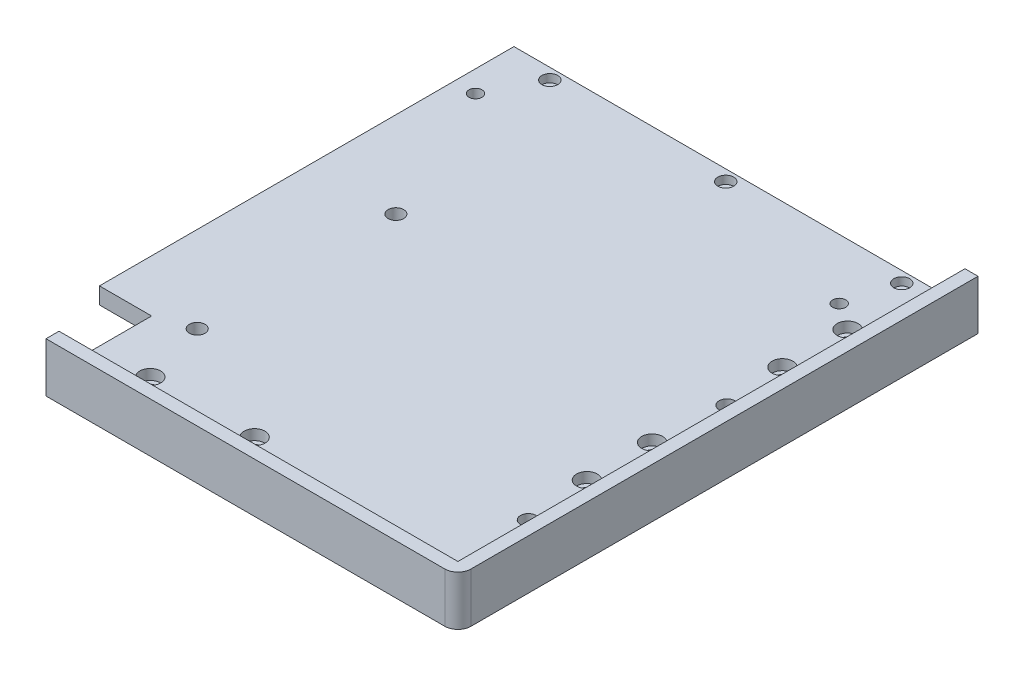
ISO-10303-21;
HEADER;
FILE_DESCRIPTION(('STEP AP214'),'2;1');
FILE_NAME('part.step','',(''),(''),'','','');
FILE_SCHEMA(('AUTOMOTIVE_DESIGN { 1 0 10303 214 1 1 1 1 }'));
ENDSEC;
DATA;
#1=APPLICATION_CONTEXT('core data for automotive mechanical design processes');
#2=APPLICATION_PROTOCOL_DEFINITION('international standard','automotive_design',2000,#1);
#3=PRODUCT_CONTEXT('',#1,'mechanical');
#4=PRODUCT('Part','Part','',(#3));
#5=PRODUCT_RELATED_PRODUCT_CATEGORY('part','',(#4));
#6=PRODUCT_DEFINITION_FORMATION('','',#4);
#7=PRODUCT_DEFINITION_CONTEXT('part definition',#1,'design');
#8=PRODUCT_DEFINITION('design','',#6,#7);
#9=PRODUCT_DEFINITION_SHAPE('','',#8);
#10=(LENGTH_UNIT() NAMED_UNIT(*) SI_UNIT(.MILLI.,.METRE.));
#11=(NAMED_UNIT(*) PLANE_ANGLE_UNIT() SI_UNIT($,.RADIAN.));
#12=(NAMED_UNIT(*) SI_UNIT($,.STERADIAN.) SOLID_ANGLE_UNIT());
#13=UNCERTAINTY_MEASURE_WITH_UNIT(LENGTH_MEASURE(1.E-05),#10,'distance_accuracy_value','');
#14=(GEOMETRIC_REPRESENTATION_CONTEXT(3) GLOBAL_UNCERTAINTY_ASSIGNED_CONTEXT((#13)) GLOBAL_UNIT_ASSIGNED_CONTEXT((#10,
#11,#12)) REPRESENTATION_CONTEXT('',''));
#15=CARTESIAN_POINT('',(0.,0.,0.));
#16=DIRECTION('',(0.,0.,1.));
#17=DIRECTION('',(1.,0.,0.));
#18=AXIS2_PLACEMENT_3D('',#15,#16,#17);
#19=CARTESIAN_POINT('',(0.,6.35,0.));
#20=DIRECTION('',(1.,0.,0.));
#21=DIRECTION('',(0.,0.,-1.));
#22=AXIS2_PLACEMENT_3D('',#19,#20,#21);
#23=PLANE('',#22);
#24=DIRECTION('',(0.,1.,0.));
#25=VECTOR('',#24,1.);
#26=CARTESIAN_POINT('',(0.,-160.252925090308,159.));
#27=LINE('',#26,#25);
#28=CARTESIAN_POINT('',(0.,0.,159.));
#29=VERTEX_POINT('',#28);
#30=CARTESIAN_POINT('',(0.,6.35,159.));
#31=VERTEX_POINT('',#30);
#32=EDGE_CURVE('E56',#29,#31,#27,.T.);
#33=ORIENTED_EDGE('',*,*,#32,.F.);
#34=DIRECTION('',(0.,0.,1.));
#35=VECTOR('',#34,1.);
#36=CARTESIAN_POINT('',(0.,0.,0.));
#37=LINE('',#36,#35);
#38=CARTESIAN_POINT('',(0.,0.,199.5));
#39=VERTEX_POINT('',#38);
#40=EDGE_CURVE('E257',#29,#39,#37,.T.);
#41=ORIENTED_EDGE('',*,*,#40,.T.);
#42=DIRECTION('',(0.,-1.,0.));
#43=VECTOR('',#42,1.);
#44=CARTESIAN_POINT('',(0.,6.35,199.5));
#45=LINE('',#44,#43);
#46=CARTESIAN_POINT('',(0.,19.05,199.5));
#47=VERTEX_POINT('',#46);
#48=EDGE_CURVE('E266',#47,#39,#45,.T.);
#49=ORIENTED_EDGE('',*,*,#48,.F.);
#50=DIRECTION('',(0.,0.,1.));
#51=VECTOR('',#50,1.);
#52=CARTESIAN_POINT('',(0.,19.05,199.5));
#53=LINE('',#52,#51);
#54=CARTESIAN_POINT('',(0.,19.05,194.5));
#55=VERTEX_POINT('',#54);
#56=EDGE_CURVE('E243',#55,#47,#53,.T.);
#57=ORIENTED_EDGE('',*,*,#56,.F.);
#58=DIRECTION('',(0.,-1.,0.));
#59=VECTOR('',#58,1.);
#60=CARTESIAN_POINT('',(0.,19.05,194.5));
#61=LINE('',#60,#59);
#62=CARTESIAN_POINT('',(0.,6.35,194.5));
#63=VERTEX_POINT('',#62);
#64=EDGE_CURVE('E246',#55,#63,#61,.T.);
#65=ORIENTED_EDGE('',*,*,#64,.T.);
#66=DIRECTION('',(0.,0.,1.));
#67=VECTOR('',#66,1.);
#68=CARTESIAN_POINT('',(0.,6.35,0.));
#69=LINE('',#68,#67);
#70=EDGE_CURVE('E131',#31,#63,#69,.T.);
#71=ORIENTED_EDGE('',*,*,#70,.F.);
#72=EDGE_LOOP('',(#33,#41,#49,#57,#65,#71));
#73=FACE_BOUND('',#72,.T.);
#74=ADVANCED_FACE('F41',(#73),#23,.F.);
#75=CARTESIAN_POINT('',(0.,6.35,199.5));
#76=DIRECTION('',(0.,0.,-1.));
#77=DIRECTION('',(-1.,0.,0.));
#78=AXIS2_PLACEMENT_3D('',#75,#76,#77);
#79=PLANE('',#78);
#80=DIRECTION('',(1.,0.,0.));
#81=VECTOR('',#80,1.);
#82=CARTESIAN_POINT('',(0.,0.,199.5));
#83=LINE('',#82,#81);
#84=CARTESIAN_POINT('',(153.,0.,199.5));
#85=VERTEX_POINT('',#84);
#86=EDGE_CURVE('E260',#39,#85,#83,.T.);
#87=ORIENTED_EDGE('',*,*,#86,.T.);
#88=DIRECTION('',(0.,-1.,0.));
#89=VECTOR('',#88,1.);
#90=CARTESIAN_POINT('',(153.,6.35,199.5));
#91=LINE('',#90,#89);
#92=CARTESIAN_POINT('',(153.,19.05,199.5));
#93=VERTEX_POINT('',#92);
#94=EDGE_CURVE('E49',#85,#93,#91,.F.);
#95=ORIENTED_EDGE('',*,*,#94,.T.);
#96=DIRECTION('',(1.,0.,0.));
#97=VECTOR('',#96,1.);
#98=CARTESIAN_POINT('',(0.,19.05,199.5));
#99=LINE('',#98,#97);
#100=EDGE_CURVE('E232',#47,#93,#99,.T.);
#101=ORIENTED_EDGE('',*,*,#100,.F.);
#102=ORIENTED_EDGE('',*,*,#48,.T.);
#103=EDGE_LOOP('',(#87,#95,#101,#102));
#104=FACE_BOUND('',#103,.T.);
#105=ADVANCED_FACE('F279',(#104),#79,.F.);
#106=CARTESIAN_POINT('',(158.,6.35,0.));
#107=DIRECTION('',(-1.,0.,0.));
#108=DIRECTION('',(0.,0.,1.));
#109=AXIS2_PLACEMENT_3D('',#106,#107,#108);
#110=PLANE('',#109);
#111=DIRECTION('',(0.,0.,-1.));
#112=VECTOR('',#111,1.);
#113=CARTESIAN_POINT('',(158.,19.05,199.5));
#114=LINE('',#113,#112);
#115=CARTESIAN_POINT('',(158.,19.05,194.5));
#116=VERTEX_POINT('',#115);
#117=CARTESIAN_POINT('',(158.,19.05,0.));
#118=VERTEX_POINT('',#117);
#119=EDGE_CURVE('E234',#116,#118,#114,.T.);
#120=ORIENTED_EDGE('',*,*,#119,.F.);
#121=DIRECTION('',(0.,-1.,0.));
#122=VECTOR('',#121,1.);
#123=CARTESIAN_POINT('',(158.,6.35,194.5));
#124=LINE('',#123,#122);
#125=CARTESIAN_POINT('',(158.,0.,194.5));
#126=VERTEX_POINT('',#125);
#127=EDGE_CURVE('E269',#116,#126,#124,.T.);
#128=ORIENTED_EDGE('',*,*,#127,.T.);
#129=DIRECTION('',(0.,0.,-1.));
#130=VECTOR('',#129,1.);
#131=CARTESIAN_POINT('',(158.,0.,0.));
#132=LINE('',#131,#130);
#133=CARTESIAN_POINT('',(158.,0.,0.));
#134=VERTEX_POINT('',#133);
#135=EDGE_CURVE('E262',#126,#134,#132,.T.);
#136=ORIENTED_EDGE('',*,*,#135,.T.);
#137=DIRECTION('',(0.,-1.,0.));
#138=VECTOR('',#137,1.);
#139=CARTESIAN_POINT('',(158.,6.35,0.));
#140=LINE('',#139,#138);
#141=EDGE_CURVE('E130',#118,#134,#140,.T.);
#142=ORIENTED_EDGE('',*,*,#141,.F.);
#143=EDGE_LOOP('',(#120,#128,#136,#142));
#144=FACE_BOUND('',#143,.T.);
#145=ADVANCED_FACE('F286',(#144),#110,.F.);
#146=CARTESIAN_POINT('',(0.,6.35,0.));
#147=DIRECTION('',(0.,0.,1.));
#148=DIRECTION('',(1.,0.,0.));
#149=AXIS2_PLACEMENT_3D('',#146,#147,#148);
#150=PLANE('',#149);
#151=DIRECTION('',(-1.,0.,0.));
#152=VECTOR('',#151,1.);
#153=CARTESIAN_POINT('',(0.,0.,0.));
#154=LINE('',#153,#152);
#155=CARTESIAN_POINT('',(-20.,0.,0.));
#156=VERTEX_POINT('',#155);
#157=EDGE_CURVE('E138',#134,#156,#154,.T.);
#158=ORIENTED_EDGE('',*,*,#157,.T.);
#159=DIRECTION('',(0.,1.,0.));
#160=VECTOR('',#159,1.);
#161=CARTESIAN_POINT('',(-20.,-160.252925090308,0.));
#162=LINE('',#161,#160);
#163=CARTESIAN_POINT('',(-20.,6.35,0.));
#164=VERTEX_POINT('',#163);
#165=EDGE_CURVE('E134',#156,#164,#162,.T.);
#166=ORIENTED_EDGE('',*,*,#165,.T.);
#167=DIRECTION('',(-1.,0.,0.));
#168=VECTOR('',#167,1.);
#169=CARTESIAN_POINT('',(0.,6.35,0.));
#170=LINE('',#169,#168);
#171=CARTESIAN_POINT('',(153.,6.35,0.));
#172=VERTEX_POINT('',#171);
#173=EDGE_CURVE('E118',#172,#164,#170,.T.);
#174=ORIENTED_EDGE('',*,*,#173,.F.);
#175=DIRECTION('',(0.,-1.,0.));
#176=VECTOR('',#175,1.);
#177=CARTESIAN_POINT('',(153.,19.05,0.));
#178=LINE('',#177,#176);
#179=CARTESIAN_POINT('',(153.,19.05,0.));
#180=VERTEX_POINT('',#179);
#181=EDGE_CURVE('E255',#180,#172,#178,.T.);
#182=ORIENTED_EDGE('',*,*,#181,.F.);
#183=DIRECTION('',(-1.,0.,0.));
#184=VECTOR('',#183,1.);
#185=CARTESIAN_POINT('',(158.,19.05,0.));
#186=LINE('',#185,#184);
#187=EDGE_CURVE('E237',#118,#180,#186,.T.);
#188=ORIENTED_EDGE('',*,*,#187,.F.);
#189=ORIENTED_EDGE('',*,*,#141,.T.);
#190=EDGE_LOOP('',(#158,#166,#174,#182,#188,#189));
#191=FACE_BOUND('',#190,.T.);
#192=ADVANCED_FACE('F135',(#191),#150,.F.);
#193=CARTESIAN_POINT('',(0.,6.35,0.));
#194=DIRECTION('',(0.,1.,0.));
#195=DIRECTION('',(0.,0.,1.));
#196=AXIS2_PLACEMENT_3D('',#193,#194,#195);
#197=PLANE('',#196);
#198=CARTESIAN_POINT('',(133.,6.35,4.25));
#199=DIRECTION('',(0.,1.,0.));
#200=DIRECTION('',(0.,0.,1.));
#201=AXIS2_PLACEMENT_3D('',#198,#199,#200);
#202=CIRCLE('',#201,3.04999999999999);
#203=CARTESIAN_POINT('',(133.,6.35,7.29999999999999));
#204=VERTEX_POINT('',#203);
#205=EDGE_CURVE('E346',#204,#204,#202,.T.);
#206=ORIENTED_EDGE('',*,*,#205,.F.);
#207=EDGE_LOOP('',(#206));
#208=FACE_BOUND('',#207,.T.);
#209=CARTESIAN_POINT('',(65.5000000000001,6.35,4.25000000000001));
#210=DIRECTION('',(0.,1.,0.));
#211=DIRECTION('',(0.,0.,1.));
#212=AXIS2_PLACEMENT_3D('',#209,#210,#211);
#213=CIRCLE('',#212,3.04999999999999);
#214=CARTESIAN_POINT('',(65.5000000000001,6.35,7.3));
#215=VERTEX_POINT('',#214);
#216=EDGE_CURVE('E343',#215,#215,#213,.T.);
#217=ORIENTED_EDGE('',*,*,#216,.F.);
#218=EDGE_LOOP('',(#217));
#219=FACE_BOUND('',#218,.T.);
#220=CARTESIAN_POINT('',(-1.99999999999995,6.35,4.25000000000002));
#221=DIRECTION('',(0.,1.,0.));
#222=DIRECTION('',(0.,0.,1.));
#223=AXIS2_PLACEMENT_3D('',#220,#221,#222);
#224=CIRCLE('',#223,3.05);
#225=CARTESIAN_POINT('',(-1.99999999999995,6.35,7.30000000000002));
#226=VERTEX_POINT('',#225);
#227=EDGE_CURVE('E337',#226,#226,#224,.T.);
#228=ORIENTED_EDGE('',*,*,#227,.F.);
#229=EDGE_LOOP('',(#228));
#230=FACE_BOUND('',#229,.T.);
#231=CARTESIAN_POINT('',(-11.75,6.35,23.));
#232=DIRECTION('',(0.,1.,0.));
#233=DIRECTION('',(0.,0.,1.));
#234=AXIS2_PLACEMENT_3D('',#231,#232,#233);
#235=CIRCLE('',#234,2.5);
#236=CARTESIAN_POINT('',(-11.75,6.35,25.5));
#237=VERTEX_POINT('',#236);
#238=EDGE_CURVE('E329',#237,#237,#235,.T.);
#239=ORIENTED_EDGE('',*,*,#238,.F.);
#240=EDGE_LOOP('',(#239));
#241=FACE_BOUND('',#240,.T.);
#242=CARTESIAN_POINT('',(127.75,6.35,23.));
#243=DIRECTION('',(0.,1.,0.));
#244=DIRECTION('',(0.,0.,1.));
#245=AXIS2_PLACEMENT_3D('',#242,#243,#244);
#246=CIRCLE('',#245,2.5);
#247=CARTESIAN_POINT('',(127.75,6.35,25.5));
#248=VERTEX_POINT('',#247);
#249=EDGE_CURVE('E325',#248,#248,#246,.T.);
#250=ORIENTED_EDGE('',*,*,#249,.F.);
#251=EDGE_LOOP('',(#250));
#252=FACE_BOUND('',#251,.T.);
#253=CARTESIAN_POINT('',(140.,6.35,154.5));
#254=DIRECTION('',(0.,1.,0.));
#255=DIRECTION('',(0.,0.,1.));
#256=AXIS2_PLACEMENT_3D('',#253,#254,#255);
#257=CIRCLE('',#256,2.99999999999999);
#258=CARTESIAN_POINT('',(140.,6.35,157.5));
#259=VERTEX_POINT('',#258);
#260=EDGE_CURVE('E307',#259,#259,#257,.T.);
#261=ORIENTED_EDGE('',*,*,#260,.F.);
#262=EDGE_LOOP('',(#261));
#263=FACE_BOUND('',#262,.T.);
#264=CARTESIAN_POINT('',(140.,6.35,78.3));
#265=DIRECTION('',(0.,1.,0.));
#266=DIRECTION('',(0.,0.,1.));
#267=AXIS2_PLACEMENT_3D('',#264,#265,#266);
#268=CIRCLE('',#267,2.99999999999999);
#269=CARTESIAN_POINT('',(140.,6.35,81.3));
#270=VERTEX_POINT('',#269);
#271=EDGE_CURVE('E314',#270,#270,#268,.T.);
#272=ORIENTED_EDGE('',*,*,#271,.F.);
#273=EDGE_LOOP('',(#272));
#274=FACE_BOUND('',#273,.T.);
#275=CARTESIAN_POINT('',(13.,6.35,78.3));
#276=DIRECTION('',(0.,1.,0.));
#277=DIRECTION('',(0.,0.,1.));
#278=AXIS2_PLACEMENT_3D('',#275,#276,#277);
#279=CIRCLE('',#278,3.);
#280=CARTESIAN_POINT('',(13.,6.35,81.3));
#281=VERTEX_POINT('',#280);
#282=EDGE_CURVE('E302',#281,#281,#279,.T.);
#283=ORIENTED_EDGE('',*,*,#282,.F.);
#284=EDGE_LOOP('',(#283));
#285=FACE_BOUND('',#284,.T.);
#286=CARTESIAN_POINT('',(13.,6.35,154.5));
#287=DIRECTION('',(0.,1.,0.));
#288=DIRECTION('',(0.,0.,1.));
#289=AXIS2_PLACEMENT_3D('',#286,#287,#288);
#290=CIRCLE('',#289,3.);
#291=CARTESIAN_POINT('',(13.,6.35,157.5));
#292=VERTEX_POINT('',#291);
#293=EDGE_CURVE('E151',#292,#292,#290,.T.);
#294=ORIENTED_EDGE('',*,*,#293,.F.);
#295=EDGE_LOOP('',(#294));
#296=FACE_BOUND('',#295,.T.);
#297=CARTESIAN_POINT('',(20.,6.35,179.5));
#298=DIRECTION('',(0.,1.,0.));
#299=DIRECTION('',(0.,0.,1.));
#300=AXIS2_PLACEMENT_3D('',#297,#298,#299);
#301=CIRCLE('',#300,4.);
#302=CARTESIAN_POINT('',(20.,6.35,183.5));
#303=VERTEX_POINT('',#302);
#304=EDGE_CURVE('E160',#303,#303,#301,.T.);
#305=ORIENTED_EDGE('',*,*,#304,.F.);
#306=EDGE_LOOP('',(#305));
#307=FACE_BOUND('',#306,.T.);
#308=CARTESIAN_POINT('',(60.,6.35,179.5));
#309=DIRECTION('',(0.,1.,0.));
#310=DIRECTION('',(0.,0.,1.));
#311=AXIS2_PLACEMENT_3D('',#308,#309,#310);
#312=CIRCLE('',#311,4.);
#313=CARTESIAN_POINT('',(60.,6.35,183.5));
#314=VERTEX_POINT('',#313);
#315=EDGE_CURVE('E172',#314,#314,#312,.T.);
#316=ORIENTED_EDGE('',*,*,#315,.F.);
#317=EDGE_LOOP('',(#316));
#318=FACE_BOUND('',#317,.T.);
#319=CARTESIAN_POINT('',(138.,6.35,130.));
#320=DIRECTION('',(0.,1.,0.));
#321=DIRECTION('',(0.,0.,1.));
#322=AXIS2_PLACEMENT_3D('',#319,#320,#321);
#323=CIRCLE('',#322,4.);
#324=CARTESIAN_POINT('',(138.,6.35,134.));
#325=VERTEX_POINT('',#324);
#326=EDGE_CURVE('E184',#325,#325,#323,.T.);
#327=ORIENTED_EDGE('',*,*,#326,.F.);
#328=EDGE_LOOP('',(#327));
#329=FACE_BOUND('',#328,.T.);
#330=CARTESIAN_POINT('',(138.,6.35,105.));
#331=DIRECTION('',(0.,1.,0.));
#332=DIRECTION('',(0.,0.,1.));
#333=AXIS2_PLACEMENT_3D('',#330,#331,#332);
#334=CIRCLE('',#333,4.);
#335=CARTESIAN_POINT('',(138.,6.35,109.));
#336=VERTEX_POINT('',#335);
#337=EDGE_CURVE('E196',#336,#336,#334,.T.);
#338=ORIENTED_EDGE('',*,*,#337,.F.);
#339=EDGE_LOOP('',(#338));
#340=FACE_BOUND('',#339,.T.);
#341=CARTESIAN_POINT('',(138.,6.35,30.));
#342=DIRECTION('',(0.,1.,0.));
#343=DIRECTION('',(0.,0.,1.));
#344=AXIS2_PLACEMENT_3D('',#341,#342,#343);
#345=CIRCLE('',#344,4.);
#346=CARTESIAN_POINT('',(138.,6.35,34.));
#347=VERTEX_POINT('',#346);
#348=EDGE_CURVE('E208',#347,#347,#345,.T.);
#349=ORIENTED_EDGE('',*,*,#348,.F.);
#350=EDGE_LOOP('',(#349));
#351=FACE_BOUND('',#350,.T.);
#352=CARTESIAN_POINT('',(138.,6.35,55.));
#353=DIRECTION('',(0.,1.,0.));
#354=DIRECTION('',(0.,0.,1.));
#355=AXIS2_PLACEMENT_3D('',#352,#353,#354);
#356=CIRCLE('',#355,4.);
#357=CARTESIAN_POINT('',(138.,6.35,59.));
#358=VERTEX_POINT('',#357);
#359=EDGE_CURVE('E220',#358,#358,#356,.T.);
#360=ORIENTED_EDGE('',*,*,#359,.F.);
#361=EDGE_LOOP('',(#360));
#362=FACE_BOUND('',#361,.T.);
#363=DIRECTION('',(-1.,0.,0.));
#364=VECTOR('',#363,1.);
#365=CARTESIAN_POINT('',(0.,6.35,194.5));
#366=LINE('',#365,#364);
#367=CARTESIAN_POINT('',(153.,6.35,194.5));
#368=VERTEX_POINT('',#367);
#369=EDGE_CURVE('E235',#368,#63,#366,.T.);
#370=ORIENTED_EDGE('',*,*,#369,.F.);
#371=DIRECTION('',(0.,0.,1.));
#372=VECTOR('',#371,1.);
#373=CARTESIAN_POINT('',(153.,6.35,194.5));
#374=LINE('',#373,#372);
#375=EDGE_CURVE('E126',#172,#368,#374,.T.);
#376=ORIENTED_EDGE('',*,*,#375,.F.);
#377=ORIENTED_EDGE('',*,*,#173,.T.);
#378=DIRECTION('',(0.,0.,1.));
#379=VECTOR('',#378,1.);
#380=CARTESIAN_POINT('',(-20.,6.35,0.));
#381=LINE('',#380,#379);
#382=CARTESIAN_POINT('',(-20.,6.35,159.));
#383=VERTEX_POINT('',#382);
#384=EDGE_CURVE('E123',#164,#383,#381,.T.);
#385=ORIENTED_EDGE('',*,*,#384,.T.);
#386=DIRECTION('',(1.,0.,0.));
#387=VECTOR('',#386,1.);
#388=CARTESIAN_POINT('',(0.,6.35,159.));
#389=LINE('',#388,#387);
#390=EDGE_CURVE('E143',#383,#31,#389,.T.);
#391=ORIENTED_EDGE('',*,*,#390,.T.);
#392=ORIENTED_EDGE('',*,*,#70,.T.);
#393=EDGE_LOOP('',(#370,#376,#377,#385,#391,#392));
#394=FACE_BOUND('',#393,.T.);
#395=ADVANCED_FACE('F120',(#208,#219,#230,#241,#252,#263,#274,#285,#296,#307,#318,#329,#340,
#351,#362,#394),#197,.T.);
#396=CARTESIAN_POINT('',(0.,0.,0.));
#397=DIRECTION('',(0.,1.,0.));
#398=DIRECTION('',(0.,0.,1.));
#399=AXIS2_PLACEMENT_3D('',#396,#397,#398);
#400=PLANE('',#399);
#401=CARTESIAN_POINT('',(-11.75,0.,23.));
#402=DIRECTION('',(0.,1.,0.));
#403=DIRECTION('',(0.,0.,1.));
#404=AXIS2_PLACEMENT_3D('',#401,#402,#403);
#405=CIRCLE('',#404,2.5);
#406=CARTESIAN_POINT('',(-11.75,0.,25.5));
#407=VERTEX_POINT('',#406);
#408=EDGE_CURVE('E308',#407,#407,#405,.T.);
#409=ORIENTED_EDGE('',*,*,#408,.T.);
#410=EDGE_LOOP('',(#409));
#411=FACE_BOUND('',#410,.T.);
#412=CARTESIAN_POINT('',(127.75,0.,23.));
#413=DIRECTION('',(0.,1.,0.));
#414=DIRECTION('',(0.,0.,1.));
#415=AXIS2_PLACEMENT_3D('',#412,#413,#414);
#416=CIRCLE('',#415,2.5);
#417=CARTESIAN_POINT('',(127.75,0.,25.5));
#418=VERTEX_POINT('',#417);
#419=EDGE_CURVE('E322',#418,#418,#416,.T.);
#420=ORIENTED_EDGE('',*,*,#419,.T.);
#421=EDGE_LOOP('',(#420));
#422=FACE_BOUND('',#421,.T.);
#423=CARTESIAN_POINT('',(140.,0.,154.5));
#424=DIRECTION('',(0.,1.,0.));
#425=DIRECTION('',(0.,0.,1.));
#426=AXIS2_PLACEMENT_3D('',#423,#424,#425);
#427=CIRCLE('',#426,2.99999999999999);
#428=CARTESIAN_POINT('',(140.,0.,157.5));
#429=VERTEX_POINT('',#428);
#430=EDGE_CURVE('E304',#429,#429,#427,.T.);
#431=ORIENTED_EDGE('',*,*,#430,.T.);
#432=EDGE_LOOP('',(#431));
#433=FACE_BOUND('',#432,.T.);
#434=CARTESIAN_POINT('',(140.,0.,78.3));
#435=DIRECTION('',(0.,1.,0.));
#436=DIRECTION('',(0.,0.,1.));
#437=AXIS2_PLACEMENT_3D('',#434,#435,#436);
#438=CIRCLE('',#437,2.99999999999999);
#439=CARTESIAN_POINT('',(140.,0.,81.3));
#440=VERTEX_POINT('',#439);
#441=EDGE_CURVE('E311',#440,#440,#438,.T.);
#442=ORIENTED_EDGE('',*,*,#441,.T.);
#443=EDGE_LOOP('',(#442));
#444=FACE_BOUND('',#443,.T.);
#445=CARTESIAN_POINT('',(13.,0.,78.3));
#446=DIRECTION('',(0.,1.,0.));
#447=DIRECTION('',(0.,0.,1.));
#448=AXIS2_PLACEMENT_3D('',#445,#446,#447);
#449=CIRCLE('',#448,3.);
#450=CARTESIAN_POINT('',(13.,0.,81.3));
#451=VERTEX_POINT('',#450);
#452=EDGE_CURVE('E317',#451,#451,#449,.T.);
#453=ORIENTED_EDGE('',*,*,#452,.T.);
#454=EDGE_LOOP('',(#453));
#455=FACE_BOUND('',#454,.T.);
#456=CARTESIAN_POINT('',(13.,0.,154.5));
#457=DIRECTION('',(0.,1.,0.));
#458=DIRECTION('',(0.,0.,1.));
#459=AXIS2_PLACEMENT_3D('',#456,#457,#458);
#460=CIRCLE('',#459,3.);
#461=CARTESIAN_POINT('',(13.,0.,157.5));
#462=VERTEX_POINT('',#461);
#463=EDGE_CURVE('E147',#462,#462,#460,.T.);
#464=ORIENTED_EDGE('',*,*,#463,.T.);
#465=EDGE_LOOP('',(#464));
#466=FACE_BOUND('',#465,.T.);
#467=CARTESIAN_POINT('',(20.,0.,179.5));
#468=DIRECTION('',(0.,1.,0.));
#469=DIRECTION('',(0.,0.,1.));
#470=AXIS2_PLACEMENT_3D('',#467,#468,#469);
#471=CIRCLE('',#470,2.25);
#472=CARTESIAN_POINT('',(20.,0.,181.75));
#473=VERTEX_POINT('',#472);
#474=EDGE_CURVE('E169',#473,#473,#471,.T.);
#475=ORIENTED_EDGE('',*,*,#474,.T.);
#476=EDGE_LOOP('',(#475));
#477=FACE_BOUND('',#476,.T.);
#478=CARTESIAN_POINT('',(60.,0.,179.5));
#479=DIRECTION('',(0.,1.,0.));
#480=DIRECTION('',(0.,0.,1.));
#481=AXIS2_PLACEMENT_3D('',#478,#479,#480);
#482=CIRCLE('',#481,2.25);
#483=CARTESIAN_POINT('',(60.,0.,181.75));
#484=VERTEX_POINT('',#483);
#485=EDGE_CURVE('E181',#484,#484,#482,.T.);
#486=ORIENTED_EDGE('',*,*,#485,.T.);
#487=EDGE_LOOP('',(#486));
#488=FACE_BOUND('',#487,.T.);
#489=CARTESIAN_POINT('',(138.,0.,130.));
#490=DIRECTION('',(0.,1.,0.));
#491=DIRECTION('',(0.,0.,1.));
#492=AXIS2_PLACEMENT_3D('',#489,#490,#491);
#493=CIRCLE('',#492,2.25);
#494=CARTESIAN_POINT('',(138.,0.,132.25));
#495=VERTEX_POINT('',#494);
#496=EDGE_CURVE('E193',#495,#495,#493,.T.);
#497=ORIENTED_EDGE('',*,*,#496,.T.);
#498=EDGE_LOOP('',(#497));
#499=FACE_BOUND('',#498,.T.);
#500=CARTESIAN_POINT('',(138.,0.,105.));
#501=DIRECTION('',(0.,1.,0.));
#502=DIRECTION('',(0.,0.,1.));
#503=AXIS2_PLACEMENT_3D('',#500,#501,#502);
#504=CIRCLE('',#503,2.25);
#505=CARTESIAN_POINT('',(138.,0.,107.25));
#506=VERTEX_POINT('',#505);
#507=EDGE_CURVE('E205',#506,#506,#504,.T.);
#508=ORIENTED_EDGE('',*,*,#507,.T.);
#509=EDGE_LOOP('',(#508));
#510=FACE_BOUND('',#509,.T.);
#511=CARTESIAN_POINT('',(138.,0.,30.));
#512=DIRECTION('',(0.,1.,0.));
#513=DIRECTION('',(0.,0.,1.));
#514=AXIS2_PLACEMENT_3D('',#511,#512,#513);
#515=CIRCLE('',#514,2.25);
#516=CARTESIAN_POINT('',(138.,0.,32.25));
#517=VERTEX_POINT('',#516);
#518=EDGE_CURVE('E217',#517,#517,#515,.T.);
#519=ORIENTED_EDGE('',*,*,#518,.T.);
#520=EDGE_LOOP('',(#519));
#521=FACE_BOUND('',#520,.T.);
#522=CARTESIAN_POINT('',(138.,0.,55.));
#523=DIRECTION('',(0.,1.,0.));
#524=DIRECTION('',(0.,0.,1.));
#525=AXIS2_PLACEMENT_3D('',#522,#523,#524);
#526=CIRCLE('',#525,2.25);
#527=CARTESIAN_POINT('',(138.,0.,57.25));
#528=VERTEX_POINT('',#527);
#529=EDGE_CURVE('E229',#528,#528,#526,.T.);
#530=ORIENTED_EDGE('',*,*,#529,.T.);
#531=EDGE_LOOP('',(#530));
#532=FACE_BOUND('',#531,.T.);
#533=ORIENTED_EDGE('',*,*,#135,.F.);
#534=CARTESIAN_POINT('',(153.,0.,194.5));
#535=DIRECTION('',(0.,1.,0.));
#536=DIRECTION('',(0.,0.,1.));
#537=AXIS2_PLACEMENT_3D('',#534,#535,#536);
#538=CIRCLE('',#537,5.);
#539=EDGE_CURVE('E272',#126,#85,#538,.F.);
#540=ORIENTED_EDGE('',*,*,#539,.T.);
#541=ORIENTED_EDGE('',*,*,#86,.F.);
#542=ORIENTED_EDGE('',*,*,#40,.F.);
#543=DIRECTION('',(-1.,0.,0.));
#544=VECTOR('',#543,1.);
#545=CARTESIAN_POINT('',(0.,0.,159.));
#546=LINE('',#545,#544);
#547=CARTESIAN_POINT('',(-20.,0.,159.));
#548=VERTEX_POINT('',#547);
#549=EDGE_CURVE('E154',#29,#548,#546,.T.);
#550=ORIENTED_EDGE('',*,*,#549,.T.);
#551=DIRECTION('',(0.,0.,-1.));
#552=VECTOR('',#551,1.);
#553=CARTESIAN_POINT('',(-20.,0.,0.));
#554=LINE('',#553,#552);
#555=EDGE_CURVE('E158',#548,#156,#554,.T.);
#556=ORIENTED_EDGE('',*,*,#555,.T.);
#557=ORIENTED_EDGE('',*,*,#157,.F.);
#558=EDGE_LOOP('',(#533,#540,#541,#542,#550,#556,#557));
#559=FACE_BOUND('',#558,.T.);
#560=ADVANCED_FACE('F276',(#411,#422,#433,#444,#455,#466,#477,#488,#499,#510,#521,#532,#559),
#400,.F.);
#561=CARTESIAN_POINT('',(153.,19.05,194.5));
#562=DIRECTION('',(1.,0.,0.));
#563=DIRECTION('',(0.,0.,-1.));
#564=AXIS2_PLACEMENT_3D('',#561,#562,#563);
#565=PLANE('',#564);
#566=ORIENTED_EDGE('',*,*,#375,.T.);
#567=DIRECTION('',(0.,-1.,0.));
#568=VECTOR('',#567,1.);
#569=CARTESIAN_POINT('',(153.,19.05,194.5));
#570=LINE('',#569,#568);
#571=CARTESIAN_POINT('',(153.,19.05,194.5));
#572=VERTEX_POINT('',#571);
#573=EDGE_CURVE('E252',#572,#368,#570,.T.);
#574=ORIENTED_EDGE('',*,*,#573,.F.);
#575=DIRECTION('',(0.,0.,1.));
#576=VECTOR('',#575,1.);
#577=CARTESIAN_POINT('',(153.,19.05,194.5));
#578=LINE('',#577,#576);
#579=EDGE_CURVE('E239',#180,#572,#578,.T.);
#580=ORIENTED_EDGE('',*,*,#579,.F.);
#581=ORIENTED_EDGE('',*,*,#181,.T.);
#582=EDGE_LOOP('',(#566,#574,#580,#581));
#583=FACE_BOUND('',#582,.T.);
#584=ADVANCED_FACE('F293',(#583),#565,.F.);
#585=CARTESIAN_POINT('',(0.,19.05,194.5));
#586=DIRECTION('',(0.,0.,1.));
#587=DIRECTION('',(1.,0.,0.));
#588=AXIS2_PLACEMENT_3D('',#585,#586,#587);
#589=PLANE('',#588);
#590=ORIENTED_EDGE('',*,*,#369,.T.);
#591=ORIENTED_EDGE('',*,*,#64,.F.);
#592=DIRECTION('',(-1.,0.,0.));
#593=VECTOR('',#592,1.);
#594=CARTESIAN_POINT('',(0.,19.05,194.5));
#595=LINE('',#594,#593);
#596=EDGE_CURVE('E241',#572,#55,#595,.T.);
#597=ORIENTED_EDGE('',*,*,#596,.F.);
#598=ORIENTED_EDGE('',*,*,#573,.T.);
#599=EDGE_LOOP('',(#590,#591,#597,#598));
#600=FACE_BOUND('',#599,.T.);
#601=ADVANCED_FACE('F295',(#600),#589,.F.);
#602=CARTESIAN_POINT('',(0.,19.05,0.));
#603=DIRECTION('',(0.,1.,0.));
#604=DIRECTION('',(0.,0.,1.));
#605=AXIS2_PLACEMENT_3D('',#602,#603,#604);
#606=PLANE('',#605);
#607=ORIENTED_EDGE('',*,*,#100,.T.);
#608=CARTESIAN_POINT('',(153.,19.05,194.5));
#609=DIRECTION('',(0.,1.,0.));
#610=DIRECTION('',(0.,0.,1.));
#611=AXIS2_PLACEMENT_3D('',#608,#609,#610);
#612=CIRCLE('',#611,5.);
#613=EDGE_CURVE('E11',#93,#116,#612,.T.);
#614=ORIENTED_EDGE('',*,*,#613,.T.);
#615=ORIENTED_EDGE('',*,*,#119,.T.);
#616=ORIENTED_EDGE('',*,*,#187,.T.);
#617=ORIENTED_EDGE('',*,*,#579,.T.);
#618=ORIENTED_EDGE('',*,*,#596,.T.);
#619=ORIENTED_EDGE('',*,*,#56,.T.);
#620=EDGE_LOOP('',(#607,#614,#615,#616,#617,#618,#619));
#621=FACE_BOUND('',#620,.T.);
#622=ADVANCED_FACE('F283',(#621),#606,.T.);
#623=CARTESIAN_POINT('',(138.,6.35,55.));
#624=DIRECTION('',(0.,1.,0.));
#625=DIRECTION('',(0.,0.,1.));
#626=AXIS2_PLACEMENT_3D('',#623,#624,#625);
#627=CYLINDRICAL_SURFACE('',#626,2.25);
#628=ORIENTED_EDGE('',*,*,#529,.F.);
#629=EDGE_LOOP('',(#628));
#630=FACE_BOUND('',#629,.T.);
#631=CARTESIAN_POINT('',(138.,2.35,55.));
#632=DIRECTION('',(0.,1.,0.));
#633=DIRECTION('',(0.,0.,1.));
#634=AXIS2_PLACEMENT_3D('',#631,#632,#633);
#635=CIRCLE('',#634,2.25);
#636=CARTESIAN_POINT('',(138.,2.35,57.25));
#637=VERTEX_POINT('',#636);
#638=EDGE_CURVE('E226',#637,#637,#635,.T.);
#639=ORIENTED_EDGE('',*,*,#638,.T.);
#640=EDGE_LOOP('',(#639));
#641=FACE_BOUND('',#640,.T.);
#642=ADVANCED_FACE('F405',(#630,#641),#627,.F.);
#643=CARTESIAN_POINT('',(140.25,2.35,55.));
#644=DIRECTION('',(0.,-1.,0.));
#645=DIRECTION('',(0.,0.,-1.));
#646=AXIS2_PLACEMENT_3D('',#643,#644,#645);
#647=PLANE('',#646);
#648=ORIENTED_EDGE('',*,*,#638,.F.);
#649=EDGE_LOOP('',(#648));
#650=FACE_BOUND('',#649,.T.);
#651=CARTESIAN_POINT('',(138.,2.35,55.));
#652=DIRECTION('',(0.,1.,0.));
#653=DIRECTION('',(0.,0.,1.));
#654=AXIS2_PLACEMENT_3D('',#651,#652,#653);
#655=CIRCLE('',#654,4.);
#656=CARTESIAN_POINT('',(138.,2.35,59.));
#657=VERTEX_POINT('',#656);
#658=EDGE_CURVE('E223',#657,#657,#655,.T.);
#659=ORIENTED_EDGE('',*,*,#658,.T.);
#660=EDGE_LOOP('',(#659));
#661=FACE_BOUND('',#660,.T.);
#662=ADVANCED_FACE('F395',(#650,#661),#647,.F.);
#663=CARTESIAN_POINT('',(138.,6.35,55.));
#664=DIRECTION('',(0.,1.,0.));
#665=DIRECTION('',(0.,0.,1.));
#666=AXIS2_PLACEMENT_3D('',#663,#664,#665);
#667=CYLINDRICAL_SURFACE('',#666,4.);
#668=ORIENTED_EDGE('',*,*,#658,.F.);
#669=EDGE_LOOP('',(#668));
#670=FACE_BOUND('',#669,.T.);
#671=ORIENTED_EDGE('',*,*,#359,.T.);
#672=EDGE_LOOP('',(#671));
#673=FACE_BOUND('',#672,.T.);
#674=ADVANCED_FACE('F392',(#670,#673),#667,.F.);
#675=CARTESIAN_POINT('',(138.,6.35,30.));
#676=DIRECTION('',(0.,1.,0.));
#677=DIRECTION('',(0.,0.,1.));
#678=AXIS2_PLACEMENT_3D('',#675,#676,#677);
#679=CYLINDRICAL_SURFACE('',#678,2.25);
#680=ORIENTED_EDGE('',*,*,#518,.F.);
#681=EDGE_LOOP('',(#680));
#682=FACE_BOUND('',#681,.T.);
#683=CARTESIAN_POINT('',(138.,2.35,30.));
#684=DIRECTION('',(0.,1.,0.));
#685=DIRECTION('',(0.,0.,1.));
#686=AXIS2_PLACEMENT_3D('',#683,#684,#685);
#687=CIRCLE('',#686,2.25);
#688=CARTESIAN_POINT('',(138.,2.35,32.25));
#689=VERTEX_POINT('',#688);
#690=EDGE_CURVE('E214',#689,#689,#687,.T.);
#691=ORIENTED_EDGE('',*,*,#690,.T.);
#692=EDGE_LOOP('',(#691));
#693=FACE_BOUND('',#692,.T.);
#694=ADVANCED_FACE('F394',(#682,#693),#679,.F.);
#695=CARTESIAN_POINT('',(140.25,2.35,30.));
#696=DIRECTION('',(0.,-1.,0.));
#697=DIRECTION('',(0.,0.,-1.));
#698=AXIS2_PLACEMENT_3D('',#695,#696,#697);
#699=PLANE('',#698);
#700=ORIENTED_EDGE('',*,*,#690,.F.);
#701=EDGE_LOOP('',(#700));
#702=FACE_BOUND('',#701,.T.);
#703=CARTESIAN_POINT('',(138.,2.35,30.));
#704=DIRECTION('',(0.,1.,0.));
#705=DIRECTION('',(0.,0.,1.));
#706=AXIS2_PLACEMENT_3D('',#703,#704,#705);
#707=CIRCLE('',#706,4.);
#708=CARTESIAN_POINT('',(138.,2.35,34.));
#709=VERTEX_POINT('',#708);
#710=EDGE_CURVE('E211',#709,#709,#707,.T.);
#711=ORIENTED_EDGE('',*,*,#710,.T.);
#712=EDGE_LOOP('',(#711));
#713=FACE_BOUND('',#712,.T.);
#714=ADVANCED_FACE('F402',(#702,#713),#699,.F.);
#715=CARTESIAN_POINT('',(138.,6.35,30.));
#716=DIRECTION('',(0.,1.,0.));
#717=DIRECTION('',(0.,0.,1.));
#718=AXIS2_PLACEMENT_3D('',#715,#716,#717);
#719=CYLINDRICAL_SURFACE('',#718,4.);
#720=ORIENTED_EDGE('',*,*,#710,.F.);
#721=EDGE_LOOP('',(#720));
#722=FACE_BOUND('',#721,.T.);
#723=ORIENTED_EDGE('',*,*,#348,.T.);
#724=EDGE_LOOP('',(#723));
#725=FACE_BOUND('',#724,.T.);
#726=ADVANCED_FACE('F466',(#722,#725),#719,.F.);
#727=CARTESIAN_POINT('',(138.,6.35,105.));
#728=DIRECTION('',(0.,1.,0.));
#729=DIRECTION('',(0.,0.,1.));
#730=AXIS2_PLACEMENT_3D('',#727,#728,#729);
#731=CYLINDRICAL_SURFACE('',#730,2.25);
#732=ORIENTED_EDGE('',*,*,#507,.F.);
#733=EDGE_LOOP('',(#732));
#734=FACE_BOUND('',#733,.T.);
#735=CARTESIAN_POINT('',(138.,2.35,105.));
#736=DIRECTION('',(0.,1.,0.));
#737=DIRECTION('',(0.,0.,1.));
#738=AXIS2_PLACEMENT_3D('',#735,#736,#737);
#739=CIRCLE('',#738,2.25);
#740=CARTESIAN_POINT('',(138.,2.35,107.25));
#741=VERTEX_POINT('',#740);
#742=EDGE_CURVE('E202',#741,#741,#739,.T.);
#743=ORIENTED_EDGE('',*,*,#742,.T.);
#744=EDGE_LOOP('',(#743));
#745=FACE_BOUND('',#744,.T.);
#746=ADVANCED_FACE('F476',(#734,#745),#731,.F.);
#747=CARTESIAN_POINT('',(140.25,2.35,105.));
#748=DIRECTION('',(0.,-1.,0.));
#749=DIRECTION('',(0.,0.,-1.));
#750=AXIS2_PLACEMENT_3D('',#747,#748,#749);
#751=PLANE('',#750);
#752=ORIENTED_EDGE('',*,*,#742,.F.);
#753=EDGE_LOOP('',(#752));
#754=FACE_BOUND('',#753,.T.);
#755=CARTESIAN_POINT('',(138.,2.35,105.));
#756=DIRECTION('',(0.,1.,0.));
#757=DIRECTION('',(0.,0.,1.));
#758=AXIS2_PLACEMENT_3D('',#755,#756,#757);
#759=CIRCLE('',#758,4.);
#760=CARTESIAN_POINT('',(138.,2.35,109.));
#761=VERTEX_POINT('',#760);
#762=EDGE_CURVE('E199',#761,#761,#759,.T.);
#763=ORIENTED_EDGE('',*,*,#762,.T.);
#764=EDGE_LOOP('',(#763));
#765=FACE_BOUND('',#764,.T.);
#766=ADVANCED_FACE('F486',(#754,#765),#751,.F.);
#767=CARTESIAN_POINT('',(138.,6.35,105.));
#768=DIRECTION('',(0.,1.,0.));
#769=DIRECTION('',(0.,0.,1.));
#770=AXIS2_PLACEMENT_3D('',#767,#768,#769);
#771=CYLINDRICAL_SURFACE('',#770,4.);
#772=ORIENTED_EDGE('',*,*,#762,.F.);
#773=EDGE_LOOP('',(#772));
#774=FACE_BOUND('',#773,.T.);
#775=ORIENTED_EDGE('',*,*,#337,.T.);
#776=EDGE_LOOP('',(#775));
#777=FACE_BOUND('',#776,.T.);
#778=ADVANCED_FACE('F496',(#774,#777),#771,.F.);
#779=CARTESIAN_POINT('',(138.,6.35,130.));
#780=DIRECTION('',(0.,1.,0.));
#781=DIRECTION('',(0.,0.,1.));
#782=AXIS2_PLACEMENT_3D('',#779,#780,#781);
#783=CYLINDRICAL_SURFACE('',#782,2.25);
#784=ORIENTED_EDGE('',*,*,#496,.F.);
#785=EDGE_LOOP('',(#784));
#786=FACE_BOUND('',#785,.T.);
#787=CARTESIAN_POINT('',(138.,2.35,130.));
#788=DIRECTION('',(0.,1.,0.));
#789=DIRECTION('',(0.,0.,1.));
#790=AXIS2_PLACEMENT_3D('',#787,#788,#789);
#791=CIRCLE('',#790,2.25);
#792=CARTESIAN_POINT('',(138.,2.35,132.25));
#793=VERTEX_POINT('',#792);
#794=EDGE_CURVE('E190',#793,#793,#791,.T.);
#795=ORIENTED_EDGE('',*,*,#794,.T.);
#796=EDGE_LOOP('',(#795));
#797=FACE_BOUND('',#796,.T.);
#798=ADVANCED_FACE('F506',(#786,#797),#783,.F.);
#799=CARTESIAN_POINT('',(140.25,2.35,130.));
#800=DIRECTION('',(0.,-1.,0.));
#801=DIRECTION('',(0.,0.,-1.));
#802=AXIS2_PLACEMENT_3D('',#799,#800,#801);
#803=PLANE('',#802);
#804=ORIENTED_EDGE('',*,*,#794,.F.);
#805=EDGE_LOOP('',(#804));
#806=FACE_BOUND('',#805,.T.);
#807=CARTESIAN_POINT('',(138.,2.35,130.));
#808=DIRECTION('',(0.,1.,0.));
#809=DIRECTION('',(0.,0.,1.));
#810=AXIS2_PLACEMENT_3D('',#807,#808,#809);
#811=CIRCLE('',#810,4.);
#812=CARTESIAN_POINT('',(138.,2.35,134.));
#813=VERTEX_POINT('',#812);
#814=EDGE_CURVE('E187',#813,#813,#811,.T.);
#815=ORIENTED_EDGE('',*,*,#814,.T.);
#816=EDGE_LOOP('',(#815));
#817=FACE_BOUND('',#816,.T.);
#818=ADVANCED_FACE('F516',(#806,#817),#803,.F.);
#819=CARTESIAN_POINT('',(138.,6.35,130.));
#820=DIRECTION('',(0.,1.,0.));
#821=DIRECTION('',(0.,0.,1.));
#822=AXIS2_PLACEMENT_3D('',#819,#820,#821);
#823=CYLINDRICAL_SURFACE('',#822,4.);
#824=ORIENTED_EDGE('',*,*,#814,.F.);
#825=EDGE_LOOP('',(#824));
#826=FACE_BOUND('',#825,.T.);
#827=ORIENTED_EDGE('',*,*,#326,.T.);
#828=EDGE_LOOP('',(#827));
#829=FACE_BOUND('',#828,.T.);
#830=ADVANCED_FACE('F526',(#826,#829),#823,.F.);
#831=CARTESIAN_POINT('',(60.,6.35,179.5));
#832=DIRECTION('',(0.,1.,0.));
#833=DIRECTION('',(0.,0.,1.));
#834=AXIS2_PLACEMENT_3D('',#831,#832,#833);
#835=CYLINDRICAL_SURFACE('',#834,2.25);
#836=ORIENTED_EDGE('',*,*,#485,.F.);
#837=EDGE_LOOP('',(#836));
#838=FACE_BOUND('',#837,.T.);
#839=CARTESIAN_POINT('',(60.,2.35,179.5));
#840=DIRECTION('',(0.,1.,0.));
#841=DIRECTION('',(0.,0.,1.));
#842=AXIS2_PLACEMENT_3D('',#839,#840,#841);
#843=CIRCLE('',#842,2.25);
#844=CARTESIAN_POINT('',(60.,2.35,181.75));
#845=VERTEX_POINT('',#844);
#846=EDGE_CURVE('E178',#845,#845,#843,.T.);
#847=ORIENTED_EDGE('',*,*,#846,.T.);
#848=EDGE_LOOP('',(#847));
#849=FACE_BOUND('',#848,.T.);
#850=ADVANCED_FACE('F536',(#838,#849),#835,.F.);
#851=CARTESIAN_POINT('',(62.25,2.35,179.5));
#852=DIRECTION('',(0.,-1.,0.));
#853=DIRECTION('',(0.,0.,-1.));
#854=AXIS2_PLACEMENT_3D('',#851,#852,#853);
#855=PLANE('',#854);
#856=ORIENTED_EDGE('',*,*,#846,.F.);
#857=EDGE_LOOP('',(#856));
#858=FACE_BOUND('',#857,.T.);
#859=CARTESIAN_POINT('',(60.,2.35,179.5));
#860=DIRECTION('',(0.,1.,0.));
#861=DIRECTION('',(0.,0.,1.));
#862=AXIS2_PLACEMENT_3D('',#859,#860,#861);
#863=CIRCLE('',#862,4.);
#864=CARTESIAN_POINT('',(60.,2.35,183.5));
#865=VERTEX_POINT('',#864);
#866=EDGE_CURVE('E175',#865,#865,#863,.T.);
#867=ORIENTED_EDGE('',*,*,#866,.T.);
#868=EDGE_LOOP('',(#867));
#869=FACE_BOUND('',#868,.T.);
#870=ADVANCED_FACE('F546',(#858,#869),#855,.F.);
#871=CARTESIAN_POINT('',(60.,6.35,179.5));
#872=DIRECTION('',(0.,1.,0.));
#873=DIRECTION('',(0.,0.,1.));
#874=AXIS2_PLACEMENT_3D('',#871,#872,#873);
#875=CYLINDRICAL_SURFACE('',#874,4.);
#876=ORIENTED_EDGE('',*,*,#866,.F.);
#877=EDGE_LOOP('',(#876));
#878=FACE_BOUND('',#877,.T.);
#879=ORIENTED_EDGE('',*,*,#315,.T.);
#880=EDGE_LOOP('',(#879));
#881=FACE_BOUND('',#880,.T.);
#882=ADVANCED_FACE('F556',(#878,#881),#875,.F.);
#883=CARTESIAN_POINT('',(20.,6.35,179.5));
#884=DIRECTION('',(0.,1.,0.));
#885=DIRECTION('',(0.,0.,1.));
#886=AXIS2_PLACEMENT_3D('',#883,#884,#885);
#887=CYLINDRICAL_SURFACE('',#886,2.25);
#888=ORIENTED_EDGE('',*,*,#474,.F.);
#889=EDGE_LOOP('',(#888));
#890=FACE_BOUND('',#889,.T.);
#891=CARTESIAN_POINT('',(20.,2.35,179.5));
#892=DIRECTION('',(0.,1.,0.));
#893=DIRECTION('',(0.,0.,1.));
#894=AXIS2_PLACEMENT_3D('',#891,#892,#893);
#895=CIRCLE('',#894,2.25);
#896=CARTESIAN_POINT('',(20.,2.35,181.75));
#897=VERTEX_POINT('',#896);
#898=EDGE_CURVE('E166',#897,#897,#895,.T.);
#899=ORIENTED_EDGE('',*,*,#898,.T.);
#900=EDGE_LOOP('',(#899));
#901=FACE_BOUND('',#900,.T.);
#902=ADVANCED_FACE('F566',(#890,#901),#887,.F.);
#903=CARTESIAN_POINT('',(22.25,2.35,179.5));
#904=DIRECTION('',(0.,-1.,0.));
#905=DIRECTION('',(0.,0.,-1.));
#906=AXIS2_PLACEMENT_3D('',#903,#904,#905);
#907=PLANE('',#906);
#908=ORIENTED_EDGE('',*,*,#898,.F.);
#909=EDGE_LOOP('',(#908));
#910=FACE_BOUND('',#909,.T.);
#911=CARTESIAN_POINT('',(20.,2.35,179.5));
#912=DIRECTION('',(0.,1.,0.));
#913=DIRECTION('',(0.,0.,1.));
#914=AXIS2_PLACEMENT_3D('',#911,#912,#913);
#915=CIRCLE('',#914,4.);
#916=CARTESIAN_POINT('',(20.,2.35,183.5));
#917=VERTEX_POINT('',#916);
#918=EDGE_CURVE('E163',#917,#917,#915,.T.);
#919=ORIENTED_EDGE('',*,*,#918,.T.);
#920=EDGE_LOOP('',(#919));
#921=FACE_BOUND('',#920,.T.);
#922=ADVANCED_FACE('F576',(#910,#921),#907,.F.);
#923=CARTESIAN_POINT('',(20.,6.35,179.5));
#924=DIRECTION('',(0.,1.,0.));
#925=DIRECTION('',(0.,0.,1.));
#926=AXIS2_PLACEMENT_3D('',#923,#924,#925);
#927=CYLINDRICAL_SURFACE('',#926,4.);
#928=ORIENTED_EDGE('',*,*,#918,.F.);
#929=EDGE_LOOP('',(#928));
#930=FACE_BOUND('',#929,.T.);
#931=ORIENTED_EDGE('',*,*,#304,.T.);
#932=EDGE_LOOP('',(#931));
#933=FACE_BOUND('',#932,.T.);
#934=ADVANCED_FACE('F586',(#930,#933),#927,.F.);
#935=CARTESIAN_POINT('',(153.,6.35,194.5));
#936=DIRECTION('',(0.,-1.,0.));
#937=DIRECTION('',(0.,0.,-1.));
#938=AXIS2_PLACEMENT_3D('',#935,#936,#937);
#939=CYLINDRICAL_SURFACE('',#938,5.);
#940=ORIENTED_EDGE('',*,*,#613,.F.);
#941=ORIENTED_EDGE('',*,*,#94,.F.);
#942=ORIENTED_EDGE('',*,*,#539,.F.);
#943=ORIENTED_EDGE('',*,*,#127,.F.);
#944=EDGE_LOOP('',(#940,#941,#942,#943));
#945=FACE_BOUND('',#944,.T.);
#946=ADVANCED_FACE('F43',(#945),#939,.T.);
#947=CARTESIAN_POINT('',(0.,-160.252925090308,159.));
#948=DIRECTION('',(0.,0.,1.));
#949=DIRECTION('',(1.,0.,0.));
#950=AXIS2_PLACEMENT_3D('',#947,#948,#949);
#951=PLANE('',#950);
#952=ORIENTED_EDGE('',*,*,#549,.F.);
#953=ORIENTED_EDGE('',*,*,#32,.T.);
#954=ORIENTED_EDGE('',*,*,#390,.F.);
#955=DIRECTION('',(0.,1.,0.));
#956=VECTOR('',#955,1.);
#957=CARTESIAN_POINT('',(-20.,-160.252925090308,159.));
#958=LINE('',#957,#956);
#959=EDGE_CURVE('E142',#548,#383,#958,.T.);
#960=ORIENTED_EDGE('',*,*,#959,.F.);
#961=EDGE_LOOP('',(#952,#953,#954,#960));
#962=FACE_BOUND('',#961,.T.);
#963=ADVANCED_FACE('F299',(#962),#951,.T.);
#964=CARTESIAN_POINT('',(-20.,-160.252925090308,0.));
#965=DIRECTION('',(-1.,0.,0.));
#966=DIRECTION('',(0.,0.,1.));
#967=AXIS2_PLACEMENT_3D('',#964,#965,#966);
#968=PLANE('',#967);
#969=ORIENTED_EDGE('',*,*,#555,.F.);
#970=ORIENTED_EDGE('',*,*,#959,.T.);
#971=ORIENTED_EDGE('',*,*,#384,.F.);
#972=ORIENTED_EDGE('',*,*,#165,.F.);
#973=EDGE_LOOP('',(#969,#970,#971,#972));
#974=FACE_BOUND('',#973,.T.);
#975=ADVANCED_FACE('F145',(#974),#968,.T.);
#976=CARTESIAN_POINT('',(13.,0.,154.5));
#977=DIRECTION('',(0.,1.,0.));
#978=DIRECTION('',(0.,0.,1.));
#979=AXIS2_PLACEMENT_3D('',#976,#977,#978);
#980=CYLINDRICAL_SURFACE('',#979,3.);
#981=ORIENTED_EDGE('',*,*,#463,.F.);
#982=EDGE_LOOP('',(#981));
#983=FACE_BOUND('',#982,.T.);
#984=ORIENTED_EDGE('',*,*,#293,.T.);
#985=EDGE_LOOP('',(#984));
#986=FACE_BOUND('',#985,.T.);
#987=ADVANCED_FACE('F657',(#983,#986),#980,.F.);
#988=CARTESIAN_POINT('',(13.,0.,78.3));
#989=DIRECTION('',(0.,1.,0.));
#990=DIRECTION('',(0.,0.,1.));
#991=AXIS2_PLACEMENT_3D('',#988,#989,#990);
#992=CYLINDRICAL_SURFACE('',#991,3.);
#993=ORIENTED_EDGE('',*,*,#452,.F.);
#994=EDGE_LOOP('',(#993));
#995=FACE_BOUND('',#994,.T.);
#996=ORIENTED_EDGE('',*,*,#282,.T.);
#997=EDGE_LOOP('',(#996));
#998=FACE_BOUND('',#997,.T.);
#999=ADVANCED_FACE('F666',(#995,#998),#992,.F.);
#1000=CARTESIAN_POINT('',(140.,0.,78.3));
#1001=DIRECTION('',(0.,1.,0.));
#1002=DIRECTION('',(0.,0.,1.));
#1003=AXIS2_PLACEMENT_3D('',#1000,#1001,#1002);
#1004=CYLINDRICAL_SURFACE('',#1003,2.99999999999999);
#1005=ORIENTED_EDGE('',*,*,#441,.F.);
#1006=EDGE_LOOP('',(#1005));
#1007=FACE_BOUND('',#1006,.T.);
#1008=ORIENTED_EDGE('',*,*,#271,.T.);
#1009=EDGE_LOOP('',(#1008));
#1010=FACE_BOUND('',#1009,.T.);
#1011=ADVANCED_FACE('F676',(#1007,#1010),#1004,.F.);
#1012=CARTESIAN_POINT('',(140.,0.,154.5));
#1013=DIRECTION('',(0.,1.,0.));
#1014=DIRECTION('',(0.,0.,1.));
#1015=AXIS2_PLACEMENT_3D('',#1012,#1013,#1014);
#1016=CYLINDRICAL_SURFACE('',#1015,2.99999999999999);
#1017=ORIENTED_EDGE('',*,*,#430,.F.);
#1018=EDGE_LOOP('',(#1017));
#1019=FACE_BOUND('',#1018,.T.);
#1020=ORIENTED_EDGE('',*,*,#260,.T.);
#1021=EDGE_LOOP('',(#1020));
#1022=FACE_BOUND('',#1021,.T.);
#1023=ADVANCED_FACE('F686',(#1019,#1022),#1016,.F.);
#1024=CARTESIAN_POINT('',(127.75,0.,23.));
#1025=DIRECTION('',(0.,1.,0.));
#1026=DIRECTION('',(0.,0.,1.));
#1027=AXIS2_PLACEMENT_3D('',#1024,#1025,#1026);
#1028=CYLINDRICAL_SURFACE('',#1027,2.5);
#1029=ORIENTED_EDGE('',*,*,#419,.F.);
#1030=EDGE_LOOP('',(#1029));
#1031=FACE_BOUND('',#1030,.T.);
#1032=ORIENTED_EDGE('',*,*,#249,.T.);
#1033=EDGE_LOOP('',(#1032));
#1034=FACE_BOUND('',#1033,.T.);
#1035=ADVANCED_FACE('F695',(#1031,#1034),#1028,.F.);
#1036=CARTESIAN_POINT('',(-11.75,0.,23.));
#1037=DIRECTION('',(0.,1.,0.));
#1038=DIRECTION('',(0.,0.,1.));
#1039=AXIS2_PLACEMENT_3D('',#1036,#1037,#1038);
#1040=CYLINDRICAL_SURFACE('',#1039,2.5);
#1041=ORIENTED_EDGE('',*,*,#408,.F.);
#1042=EDGE_LOOP('',(#1041));
#1043=FACE_BOUND('',#1042,.T.);
#1044=ORIENTED_EDGE('',*,*,#238,.T.);
#1045=EDGE_LOOP('',(#1044));
#1046=FACE_BOUND('',#1045,.T.);
#1047=ADVANCED_FACE('F704',(#1043,#1046),#1040,.F.);
#1048=CARTESIAN_POINT('',(-1.99999999999995,3.25,4.25000000000002));
#1049=DIRECTION('',(0.,1.,0.));
#1050=DIRECTION('',(0.,0.,1.));
#1051=AXIS2_PLACEMENT_3D('',#1048,#1049,#1050);
#1052=CYLINDRICAL_SURFACE('',#1051,3.05);
#1053=CARTESIAN_POINT('',(-1.99999999999995,3.25,4.25000000000002));
#1054=DIRECTION('',(0.,1.,0.));
#1055=DIRECTION('',(0.,0.,1.));
#1056=AXIS2_PLACEMENT_3D('',#1053,#1054,#1055);
#1057=CIRCLE('',#1056,3.05);
#1058=CARTESIAN_POINT('',(-1.99999999999995,3.25,7.30000000000002));
#1059=VERTEX_POINT('',#1058);
#1060=EDGE_CURVE('E334',#1059,#1059,#1057,.T.);
#1061=ORIENTED_EDGE('',*,*,#1060,.F.);
#1062=EDGE_LOOP('',(#1061));
#1063=FACE_BOUND('',#1062,.T.);
#1064=ORIENTED_EDGE('',*,*,#227,.T.);
#1065=EDGE_LOOP('',(#1064));
#1066=FACE_BOUND('',#1065,.T.);
#1067=ADVANCED_FACE('F713',(#1063,#1066),#1052,.F.);
#1068=CARTESIAN_POINT('',(-1.99999999999995,3.25,4.25000000000002));
#1069=DIRECTION('',(0.,1.,0.));
#1070=DIRECTION('',(0.,0.,1.));
#1071=AXIS2_PLACEMENT_3D('',#1068,#1069,#1070);
#1072=PLANE('',#1071);
#1073=ORIENTED_EDGE('',*,*,#1060,.T.);
#1074=EDGE_LOOP('',(#1073));
#1075=FACE_BOUND('',#1074,.T.);
#1076=ADVANCED_FACE('F722',(#1075),#1072,.T.);
#1077=CARTESIAN_POINT('',(65.5000000000001,3.25,4.25000000000001));
#1078=DIRECTION('',(0.,1.,0.));
#1079=DIRECTION('',(0.,0.,1.));
#1080=AXIS2_PLACEMENT_3D('',#1077,#1078,#1079);
#1081=CYLINDRICAL_SURFACE('',#1080,3.04999999999999);
#1082=CARTESIAN_POINT('',(65.5000000000001,3.25,4.25000000000001));
#1083=DIRECTION('',(0.,1.,0.));
#1084=DIRECTION('',(0.,0.,1.));
#1085=AXIS2_PLACEMENT_3D('',#1082,#1083,#1084);
#1086=CIRCLE('',#1085,3.04999999999999);
#1087=CARTESIAN_POINT('',(65.5000000000001,3.25,7.3));
#1088=VERTEX_POINT('',#1087);
#1089=EDGE_CURVE('E340',#1088,#1088,#1086,.T.);
#1090=ORIENTED_EDGE('',*,*,#1089,.F.);
#1091=EDGE_LOOP('',(#1090));
#1092=FACE_BOUND('',#1091,.T.);
#1093=ORIENTED_EDGE('',*,*,#216,.T.);
#1094=EDGE_LOOP('',(#1093));
#1095=FACE_BOUND('',#1094,.T.);
#1096=ADVANCED_FACE('F732',(#1092,#1095),#1081,.F.);
#1097=CARTESIAN_POINT('',(65.5000000000001,3.25,4.25000000000001));
#1098=DIRECTION('',(0.,1.,0.));
#1099=DIRECTION('',(0.,0.,1.));
#1100=AXIS2_PLACEMENT_3D('',#1097,#1098,#1099);
#1101=PLANE('',#1100);
#1102=ORIENTED_EDGE('',*,*,#1089,.T.);
#1103=EDGE_LOOP('',(#1102));
#1104=FACE_BOUND('',#1103,.T.);
#1105=ADVANCED_FACE('F357',(#1104),#1101,.T.);
#1106=CARTESIAN_POINT('',(133.,3.25,4.25));
#1107=DIRECTION('',(0.,1.,0.));
#1108=DIRECTION('',(0.,0.,1.));
#1109=AXIS2_PLACEMENT_3D('',#1106,#1107,#1108);
#1110=CYLINDRICAL_SURFACE('',#1109,3.04999999999999);
#1111=CARTESIAN_POINT('',(133.,3.25,4.25));
#1112=DIRECTION('',(0.,1.,0.));
#1113=DIRECTION('',(0.,0.,1.));
#1114=AXIS2_PLACEMENT_3D('',#1111,#1112,#1113);
#1115=CIRCLE('',#1114,3.04999999999999);
#1116=CARTESIAN_POINT('',(133.,3.25,7.29999999999999));
#1117=VERTEX_POINT('',#1116);
#1118=EDGE_CURVE('E326',#1117,#1117,#1115,.T.);
#1119=ORIENTED_EDGE('',*,*,#1118,.F.);
#1120=EDGE_LOOP('',(#1119));
#1121=FACE_BOUND('',#1120,.T.);
#1122=ORIENTED_EDGE('',*,*,#205,.T.);
#1123=EDGE_LOOP('',(#1122));
#1124=FACE_BOUND('',#1123,.T.);
#1125=ADVANCED_FACE('F354',(#1121,#1124),#1110,.F.);
#1126=CARTESIAN_POINT('',(133.,3.25,4.25));
#1127=DIRECTION('',(0.,1.,0.));
#1128=DIRECTION('',(0.,0.,1.));
#1129=AXIS2_PLACEMENT_3D('',#1126,#1127,#1128);
#1130=PLANE('',#1129);
#1131=ORIENTED_EDGE('',*,*,#1118,.T.);
#1132=EDGE_LOOP('',(#1131));
#1133=FACE_BOUND('',#1132,.T.);
#1134=ADVANCED_FACE('F352',(#1133),#1130,.T.);
#1135=CLOSED_SHELL('',(#74,#105,#145,#192,#395,#560,#584,#601,#622,#642,#662,#674,#694,#714,
#726,#746,#766,#778,#798,#818,#830,#850,#870,#882,#902,#922,#934,#946,#963,#975,#987,#999,#1011,
#1023,#1035,#1047,#1067,#1076,#1096,#1105,#1125,#1134));
#1136=MANIFOLD_SOLID_BREP('B2',#1135);
#1137=ADVANCED_BREP_SHAPE_REPRESENTATION('',(#18,#1136),#14);
#1138=SHAPE_DEFINITION_REPRESENTATION(#9,#1137);
ENDSEC;
END-ISO-10303-21;
